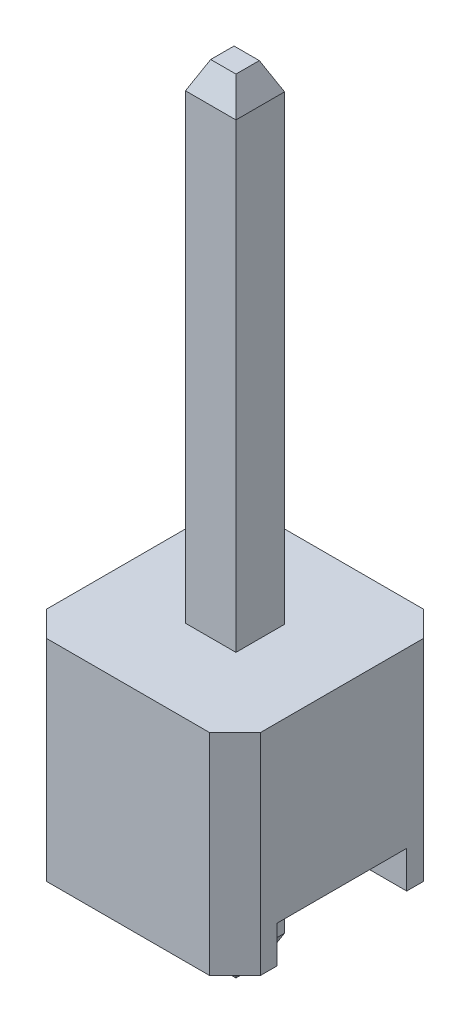
ISO-10303-21;
HEADER;
FILE_DESCRIPTION(('STEP AP214'),'2;1');
FILE_NAME('part.step','',(''),(''),'','','');
FILE_SCHEMA(('AUTOMOTIVE_DESIGN { 1 0 10303 214 1 1 1 1 }'));
ENDSEC;
DATA;
#1=APPLICATION_CONTEXT('core data for automotive mechanical design processes');
#2=APPLICATION_PROTOCOL_DEFINITION('international standard','automotive_design',2000,#1);
#3=PRODUCT_CONTEXT('',#1,'mechanical');
#4=PRODUCT('Part','Part','',(#3));
#5=PRODUCT_RELATED_PRODUCT_CATEGORY('part','',(#4));
#6=PRODUCT_DEFINITION_FORMATION('','',#4);
#7=PRODUCT_DEFINITION_CONTEXT('part definition',#1,'design');
#8=PRODUCT_DEFINITION('design','',#6,#7);
#9=PRODUCT_DEFINITION_SHAPE('','',#8);
#10=(LENGTH_UNIT() NAMED_UNIT(*) SI_UNIT(.MILLI.,.METRE.));
#11=(NAMED_UNIT(*) PLANE_ANGLE_UNIT() SI_UNIT($,.RADIAN.));
#12=(NAMED_UNIT(*) SI_UNIT($,.STERADIAN.) SOLID_ANGLE_UNIT());
#13=UNCERTAINTY_MEASURE_WITH_UNIT(LENGTH_MEASURE(1.E-05),#10,'distance_accuracy_value','');
#14=(GEOMETRIC_REPRESENTATION_CONTEXT(3) GLOBAL_UNCERTAINTY_ASSIGNED_CONTEXT((#13)) GLOBAL_UNIT_ASSIGNED_CONTEXT((#10,
#11,#12)) REPRESENTATION_CONTEXT('',''));
#15=CARTESIAN_POINT('',(0.,0.,0.));
#16=DIRECTION('',(0.,0.,1.));
#17=DIRECTION('',(1.,0.,0.));
#18=AXIS2_PLACEMENT_3D('',#15,#16,#17);
#19=CARTESIAN_POINT('',(15.6674969604626,-5.69124998633488,4.81287404611807));
#20=DIRECTION('',(0.,-1.,0.));
#21=DIRECTION('',(0.,0.,-1.));
#22=AXIS2_PLACEMENT_3D('',#19,#20,#21);
#23=PLANE('',#22);
#24=DIRECTION('',(1.,0.,0.));
#25=VECTOR('',#24,1.);
#26=CARTESIAN_POINT('',(15.0674969604626,-5.69124998633488,4.96287404611807));
#27=LINE('',#26,#25);
#28=CARTESIAN_POINT('',(15.2174969604626,-5.69124998633488,4.96287404611807));
#29=VERTEX_POINT('',#28);
#30=CARTESIAN_POINT('',(15.5174969604626,-5.69124998633488,4.96287404611807));
#31=VERTEX_POINT('',#30);
#32=EDGE_CURVE('E194',#29,#31,#27,.T.);
#33=ORIENTED_EDGE('',*,*,#32,.T.);
#34=DIRECTION('',(0.,0.,1.));
#35=VECTOR('',#34,1.);
#36=CARTESIAN_POINT('',(15.5174969604626,-5.69124998633488,4.81287404611807));
#37=LINE('',#36,#35);
#38=CARTESIAN_POINT('',(15.5174969604626,-5.69124998633488,5.24038017622598));
#39=VERTEX_POINT('',#38);
#40=EDGE_CURVE('E179',#31,#39,#37,.T.);
#41=ORIENTED_EDGE('',*,*,#40,.T.);
#42=DIRECTION('',(1.,0.,0.));
#43=VECTOR('',#42,1.);
#44=CARTESIAN_POINT('',(15.6674969604626,-5.69124998633488,5.24038017622598));
#45=LINE('',#44,#43);
#46=CARTESIAN_POINT('',(15.2174969604626,-5.69124998633488,5.24038017622598));
#47=VERTEX_POINT('',#46);
#48=EDGE_CURVE('E20',#39,#47,#45,.F.);
#49=ORIENTED_EDGE('',*,*,#48,.T.);
#50=DIRECTION('',(0.,0.,1.));
#51=VECTOR('',#50,1.);
#52=CARTESIAN_POINT('',(15.2174969604626,-5.69124998633488,5.39038017622598));
#53=LINE('',#52,#51);
#54=EDGE_CURVE('E174',#47,#29,#53,.F.);
#55=ORIENTED_EDGE('',*,*,#54,.T.);
#56=EDGE_LOOP('',(#33,#41,#49,#55));
#57=FACE_BOUND('',#56,.T.);
#58=ADVANCED_FACE('F17',(#57),#23,.T.);
#59=CARTESIAN_POINT('',(15.6674969604626,-5.36957394825845,5.39038017622598));
#60=DIRECTION('',(0.,0.4226182617407,-0.90630778703665));
#61=DIRECTION('',(0.,0.90630778703665,0.4226182617407));
#62=AXIS2_PLACEMENT_3D('',#59,#60,#61);
#63=PLANE('',#62);
#64=DIRECTION('',(1.,0.,0.));
#65=VECTOR('',#64,1.);
#66=CARTESIAN_POINT('',(15.6674969604626,-5.36957394825845,5.39038017622598));
#67=LINE('',#66,#65);
#68=CARTESIAN_POINT('',(15.0674969604626,-5.36957394825845,5.39038017622598));
#69=VERTEX_POINT('',#68);
#70=CARTESIAN_POINT('',(15.6674969604626,-5.36957394825845,5.39038017622598));
#71=VERTEX_POINT('',#70);
#72=EDGE_CURVE('E186',#69,#71,#67,.T.);
#73=ORIENTED_EDGE('',*,*,#72,.F.);
#74=DIRECTION('',(0.389281620635027,-0.834817129478987,-0.389281620635025));
#75=VECTOR('',#74,1.);
#76=CARTESIAN_POINT('',(15.0674969604626,-5.36957394825845,5.39038017622598));
#77=LINE('',#76,#75);
#78=EDGE_CURVE('E182',#69,#47,#77,.T.);
#79=ORIENTED_EDGE('',*,*,#78,.T.);
#80=ORIENTED_EDGE('',*,*,#48,.F.);
#81=DIRECTION('',(0.389281620635028,0.834817129478986,0.389281620635026));
#82=VECTOR('',#81,1.);
#83=CARTESIAN_POINT('',(15.5174969604626,-5.69124998633488,5.24038017622598));
#84=LINE('',#83,#82);
#85=EDGE_CURVE('E202',#39,#71,#84,.T.);
#86=ORIENTED_EDGE('',*,*,#85,.T.);
#87=EDGE_LOOP('',(#73,#79,#80,#86));
#88=FACE_BOUND('',#87,.T.);
#89=ADVANCED_FACE('F184',(#88),#63,.F.);
#90=CARTESIAN_POINT('',(15.0674969604626,-5.36957394825845,5.39038017622598));
#91=DIRECTION('',(0.906307787036649,0.422618261740701,0.));
#92=DIRECTION('',(-0.422618261740701,0.906307787036649,0.));
#93=AXIS2_PLACEMENT_3D('',#90,#91,#92);
#94=PLANE('',#93);
#95=ORIENTED_EDGE('',*,*,#54,.F.);
#96=ORIENTED_EDGE('',*,*,#78,.F.);
#97=DIRECTION('',(0.,0.,1.));
#98=VECTOR('',#97,1.);
#99=CARTESIAN_POINT('',(15.0674969604626,-5.36957394825845,5.39038017622598));
#100=LINE('',#99,#98);
#101=CARTESIAN_POINT('',(15.0674969604626,-5.36957394825845,4.81287404611807));
#102=VERTEX_POINT('',#101);
#103=EDGE_CURVE('E205',#102,#69,#100,.T.);
#104=ORIENTED_EDGE('',*,*,#103,.F.);
#105=DIRECTION('',(0.389281620635028,-0.834817129478986,0.389281620635026));
#106=VECTOR('',#105,1.);
#107=CARTESIAN_POINT('',(15.0674969604626,-5.36957394825845,4.81287404611807));
#108=LINE('',#107,#106);
#109=EDGE_CURVE('E191',#102,#29,#108,.T.);
#110=ORIENTED_EDGE('',*,*,#109,.T.);
#111=EDGE_LOOP('',(#95,#96,#104,#110));
#112=FACE_BOUND('',#111,.T.);
#113=ADVANCED_FACE('F189',(#112),#94,.F.);
#114=CARTESIAN_POINT('',(15.0674969604626,-5.36957394825845,4.81287404611807));
#115=DIRECTION('',(0.,0.422618261740701,0.906307787036649));
#116=DIRECTION('',(0.,-0.906307787036649,0.422618261740701));
#117=AXIS2_PLACEMENT_3D('',#114,#115,#116);
#118=PLANE('',#117);
#119=ORIENTED_EDGE('',*,*,#32,.F.);
#120=ORIENTED_EDGE('',*,*,#109,.F.);
#121=DIRECTION('',(-1.,0.,0.));
#122=VECTOR('',#121,1.);
#123=CARTESIAN_POINT('',(15.0674969604626,-5.36957394825845,4.81287404611807));
#124=LINE('',#123,#122);
#125=CARTESIAN_POINT('',(15.6674969604626,-5.36957394825845,4.81287404611807));
#126=VERTEX_POINT('',#125);
#127=EDGE_CURVE('E211',#126,#102,#124,.T.);
#128=ORIENTED_EDGE('',*,*,#127,.F.);
#129=DIRECTION('',(-0.389281620635029,-0.834817129478988,0.389281620635022));
#130=VECTOR('',#129,1.);
#131=CARTESIAN_POINT('',(15.6674969604626,-5.36957394825845,4.81287404611807));
#132=LINE('',#131,#130);
#133=EDGE_CURVE('E198',#126,#31,#132,.T.);
#134=ORIENTED_EDGE('',*,*,#133,.T.);
#135=EDGE_LOOP('',(#119,#120,#128,#134));
#136=FACE_BOUND('',#135,.T.);
#137=ADVANCED_FACE('F518',(#136),#118,.F.);
#138=CARTESIAN_POINT('',(15.6674969604626,-5.36957394825845,4.81287404611807));
#139=DIRECTION('',(-0.906307787036649,0.422618261740701,0.));
#140=DIRECTION('',(-0.422618261740701,-0.906307787036649,0.));
#141=AXIS2_PLACEMENT_3D('',#138,#139,#140);
#142=PLANE('',#141);
#143=ORIENTED_EDGE('',*,*,#40,.F.);
#144=ORIENTED_EDGE('',*,*,#133,.F.);
#145=DIRECTION('',(0.,0.,-1.));
#146=VECTOR('',#145,1.);
#147=CARTESIAN_POINT('',(15.6674969604626,-5.36957394825845,4.81287404611807));
#148=LINE('',#147,#146);
#149=EDGE_CURVE('E220',#71,#126,#148,.T.);
#150=ORIENTED_EDGE('',*,*,#149,.F.);
#151=ORIENTED_EDGE('',*,*,#85,.F.);
#152=EDGE_LOOP('',(#143,#144,#150,#151));
#153=FACE_BOUND('',#152,.T.);
#154=ADVANCED_FACE('F514',(#153),#142,.F.);
#155=CARTESIAN_POINT('',(15.6674969604626,-5.69124998633488,5.39038017622598));
#156=DIRECTION('',(0.,0.,1.));
#157=DIRECTION('',(1.,0.,0.));
#158=AXIS2_PLACEMENT_3D('',#155,#156,#157);
#159=PLANE('',#158);
#160=DIRECTION('',(0.,1.,0.));
#161=VECTOR('',#160,1.);
#162=CARTESIAN_POINT('',(15.6674969604626,-5.69124998633488,5.39038017622598));
#163=LINE('',#162,#161);
#164=CARTESIAN_POINT('',(15.6674969604626,-4.25124998633488,5.39038017622598));
#165=VERTEX_POINT('',#164);
#166=EDGE_CURVE('E217',#165,#71,#163,.F.);
#167=ORIENTED_EDGE('',*,*,#166,.F.);
#168=DIRECTION('',(1.,0.,0.));
#169=VECTOR('',#168,1.);
#170=CARTESIAN_POINT('',(14.0974969604626,-4.25124998633488,5.39038017622598));
#171=LINE('',#170,#169);
#172=CARTESIAN_POINT('',(15.0674969604626,-4.25124998633488,5.39038017622598));
#173=VERTEX_POINT('',#172);
#174=EDGE_CURVE('E230',#165,#173,#171,.F.);
#175=ORIENTED_EDGE('',*,*,#174,.T.);
#176=DIRECTION('',(0.,1.,0.));
#177=VECTOR('',#176,1.);
#178=CARTESIAN_POINT('',(15.0674969604626,-5.69124998633488,5.39038017622598));
#179=LINE('',#178,#177);
#180=EDGE_CURVE('E208',#69,#173,#179,.T.);
#181=ORIENTED_EDGE('',*,*,#180,.F.);
#182=ORIENTED_EDGE('',*,*,#72,.T.);
#183=EDGE_LOOP('',(#167,#175,#181,#182));
#184=FACE_BOUND('',#183,.T.);
#185=ADVANCED_FACE('F510',(#184),#159,.T.);
#186=CARTESIAN_POINT('',(15.0674969604626,-5.69124998633488,5.39038017622598));
#187=DIRECTION('',(-1.,0.,0.));
#188=DIRECTION('',(0.,0.,1.));
#189=AXIS2_PLACEMENT_3D('',#186,#187,#188);
#190=PLANE('',#189);
#191=ORIENTED_EDGE('',*,*,#180,.T.);
#192=DIRECTION('',(0.,0.,1.));
#193=VECTOR('',#192,1.);
#194=CARTESIAN_POINT('',(15.0674969604626,-4.25124998633488,5.87162711117202));
#195=LINE('',#194,#193);
#196=CARTESIAN_POINT('',(15.0674969604626,-4.25124998633488,4.81287404611807));
#197=VERTEX_POINT('',#196);
#198=EDGE_CURVE('E232',#173,#197,#195,.F.);
#199=ORIENTED_EDGE('',*,*,#198,.T.);
#200=DIRECTION('',(0.,1.,0.));
#201=VECTOR('',#200,1.);
#202=CARTESIAN_POINT('',(15.0674969604626,-5.69124998633488,4.81287404611807));
#203=LINE('',#202,#201);
#204=EDGE_CURVE('E214',#102,#197,#203,.T.);
#205=ORIENTED_EDGE('',*,*,#204,.F.);
#206=ORIENTED_EDGE('',*,*,#103,.T.);
#207=EDGE_LOOP('',(#191,#199,#205,#206));
#208=FACE_BOUND('',#207,.T.);
#209=ADVANCED_FACE('F506',(#208),#190,.T.);
#210=CARTESIAN_POINT('',(15.0674969604626,-5.69124998633488,4.81287404611807));
#211=DIRECTION('',(0.,0.,-1.));
#212=DIRECTION('',(-1.,0.,0.));
#213=AXIS2_PLACEMENT_3D('',#210,#211,#212);
#214=PLANE('',#213);
#215=ORIENTED_EDGE('',*,*,#204,.T.);
#216=DIRECTION('',(1.,0.,0.));
#217=VECTOR('',#216,1.);
#218=CARTESIAN_POINT('',(14.0974969604626,-4.25124998633488,4.81287404611807));
#219=LINE('',#218,#217);
#220=CARTESIAN_POINT('',(15.6674969604626,-4.25124998633488,4.81287404611807));
#221=VERTEX_POINT('',#220);
#222=EDGE_CURVE('E234',#197,#221,#219,.T.);
#223=ORIENTED_EDGE('',*,*,#222,.T.);
#224=DIRECTION('',(0.,1.,0.));
#225=VECTOR('',#224,1.);
#226=CARTESIAN_POINT('',(15.6674969604626,-5.69124998633488,4.81287404611807));
#227=LINE('',#226,#225);
#228=EDGE_CURVE('E223',#126,#221,#227,.T.);
#229=ORIENTED_EDGE('',*,*,#228,.F.);
#230=ORIENTED_EDGE('',*,*,#127,.T.);
#231=EDGE_LOOP('',(#215,#223,#229,#230));
#232=FACE_BOUND('',#231,.T.);
#233=ADVANCED_FACE('F502',(#232),#214,.T.);
#234=CARTESIAN_POINT('',(15.6674969604626,-5.69124998633488,4.81287404611807));
#235=DIRECTION('',(1.,0.,0.));
#236=DIRECTION('',(0.,0.,-1.));
#237=AXIS2_PLACEMENT_3D('',#234,#235,#236);
#238=PLANE('',#237);
#239=ORIENTED_EDGE('',*,*,#228,.T.);
#240=DIRECTION('',(0.,0.,1.));
#241=VECTOR('',#240,1.);
#242=CARTESIAN_POINT('',(15.6674969604626,-4.25124998633488,5.87162711117202));
#243=LINE('',#242,#241);
#244=EDGE_CURVE('E236',#221,#165,#243,.T.);
#245=ORIENTED_EDGE('',*,*,#244,.T.);
#246=ORIENTED_EDGE('',*,*,#166,.T.);
#247=ORIENTED_EDGE('',*,*,#149,.T.);
#248=EDGE_LOOP('',(#239,#245,#246,#247));
#249=FACE_BOUND('',#248,.T.);
#250=ADVANCED_FACE('F498',(#249),#238,.T.);
#251=CARTESIAN_POINT('',(14.0974969604626,-4.25124998633488,5.87162711117202));
#252=DIRECTION('',(0.,1.,0.));
#253=DIRECTION('',(0.,0.,1.));
#254=AXIS2_PLACEMENT_3D('',#251,#252,#253);
#255=PLANE('',#254);
#256=ORIENTED_EDGE('',*,*,#222,.F.);
#257=ORIENTED_EDGE('',*,*,#198,.F.);
#258=ORIENTED_EDGE('',*,*,#174,.F.);
#259=ORIENTED_EDGE('',*,*,#244,.F.);
#260=EDGE_LOOP('',(#256,#257,#258,#259));
#261=FACE_BOUND('',#260,.T.);
#262=DIRECTION('',(-1.,0.,0.));
#263=VECTOR('',#262,1.);
#264=CARTESIAN_POINT('',(14.0974969604626,-4.25124998633488,4.33162711117202));
#265=LINE('',#264,#263);
#266=CARTESIAN_POINT('',(14.0974969604626,-4.25124998633488,4.33162711117202));
#267=VERTEX_POINT('',#266);
#268=CARTESIAN_POINT('',(16.6374969604626,-4.25124998633488,4.33162711117202));
#269=VERTEX_POINT('',#268);
#270=EDGE_CURVE('E241',#267,#269,#265,.F.);
#271=ORIENTED_EDGE('',*,*,#270,.T.);
#272=DIRECTION('',(0.,0.,1.));
#273=VECTOR('',#272,1.);
#274=CARTESIAN_POINT('',(16.6374969604626,-4.25124998633488,5.87162711117202));
#275=LINE('',#274,#273);
#276=CARTESIAN_POINT('',(16.6374969604626,-4.25124998633488,5.87162711117202));
#277=VERTEX_POINT('',#276);
#278=EDGE_CURVE('E226',#277,#269,#275,.F.);
#279=ORIENTED_EDGE('',*,*,#278,.F.);
#280=DIRECTION('',(1.,0.,0.));
#281=VECTOR('',#280,1.);
#282=CARTESIAN_POINT('',(14.0974969604626,-4.25124998633488,5.87162711117202));
#283=LINE('',#282,#281);
#284=CARTESIAN_POINT('',(14.0974969604626,-4.25124998633488,5.87162711117202));
#285=VERTEX_POINT('',#284);
#286=EDGE_CURVE('E248',#277,#285,#283,.F.);
#287=ORIENTED_EDGE('',*,*,#286,.T.);
#288=DIRECTION('',(0.,0.,1.));
#289=VECTOR('',#288,1.);
#290=CARTESIAN_POINT('',(14.0974969604626,-4.25124998633488,5.87162711117202));
#291=LINE('',#290,#289);
#292=EDGE_CURVE('E228',#267,#285,#291,.T.);
#293=ORIENTED_EDGE('',*,*,#292,.F.);
#294=EDGE_LOOP('',(#271,#279,#287,#293));
#295=FACE_BOUND('',#294,.T.);
#296=ADVANCED_FACE('F495',(#261,#295),#255,.F.);
#297=CARTESIAN_POINT('',(15.5174969604626,3.60875001366512,4.81287404611807));
#298=DIRECTION('',(0.906307787036651,0.422618261740697,0.));
#299=DIRECTION('',(-0.422618261740697,0.906307787036651,0.));
#300=AXIS2_PLACEMENT_3D('',#297,#298,#299);
#301=PLANE('',#300);
#302=DIRECTION('',(0.389281620635022,-0.83481712947899,-0.389281620635024));
#303=VECTOR('',#302,1.);
#304=CARTESIAN_POINT('',(15.5174969604626,3.60875001366512,4.96287404611807));
#305=LINE('',#304,#303);
#306=CARTESIAN_POINT('',(15.5174969604626,3.60875001366512,4.96287404611807));
#307=VERTEX_POINT('',#306);
#308=CARTESIAN_POINT('',(15.6674969604626,3.28707397558869,4.81287404611807));
#309=VERTEX_POINT('',#308);
#310=EDGE_CURVE('E263',#307,#309,#305,.T.);
#311=ORIENTED_EDGE('',*,*,#310,.F.);
#312=DIRECTION('',(0.,0.,-1.));
#313=VECTOR('',#312,1.);
#314=CARTESIAN_POINT('',(15.5174969604626,3.60875001366512,4.81287404611807));
#315=LINE('',#314,#313);
#316=CARTESIAN_POINT('',(15.5174969604626,3.60875001366512,5.24038017622598));
#317=VERTEX_POINT('',#316);
#318=EDGE_CURVE('E256',#307,#317,#315,.F.);
#319=ORIENTED_EDGE('',*,*,#318,.T.);
#320=DIRECTION('',(-0.389281620635021,0.834817129478991,-0.389281620635023));
#321=VECTOR('',#320,1.);
#322=CARTESIAN_POINT('',(15.6674969604626,3.28707397558869,5.39038017622598));
#323=LINE('',#322,#321);
#324=CARTESIAN_POINT('',(15.6674969604626,3.28707397558869,5.39038017622598));
#325=VERTEX_POINT('',#324);
#326=EDGE_CURVE('E253',#325,#317,#323,.T.);
#327=ORIENTED_EDGE('',*,*,#326,.F.);
#328=DIRECTION('',(0.,0.,-1.));
#329=VECTOR('',#328,1.);
#330=CARTESIAN_POINT('',(15.6674969604626,3.28707397558869,4.81287404611807));
#331=LINE('',#330,#329);
#332=EDGE_CURVE('E266',#309,#325,#331,.F.);
#333=ORIENTED_EDGE('',*,*,#332,.F.);
#334=EDGE_LOOP('',(#311,#319,#327,#333));
#335=FACE_BOUND('',#334,.T.);
#336=ADVANCED_FACE('F472',(#335),#301,.T.);
#337=CARTESIAN_POINT('',(14.0974969604626,-4.25124998633488,4.33162711117202));
#338=DIRECTION('',(0.,0.,-1.));
#339=DIRECTION('',(-1.,0.,0.));
#340=AXIS2_PLACEMENT_3D('',#337,#338,#339);
#341=PLANE('',#340);
#342=DIRECTION('',(0.,1.,0.));
#343=VECTOR('',#342,1.);
#344=CARTESIAN_POINT('',(16.6374969604626,-4.25124998633488,4.33162711117202));
#345=LINE('',#344,#343);
#346=CARTESIAN_POINT('',(16.6374969604626,-4.69124998633488,4.33162711117202));
#347=VERTEX_POINT('',#346);
#348=EDGE_CURVE('E244',#269,#347,#345,.F.);
#349=ORIENTED_EDGE('',*,*,#348,.F.);
#350=ORIENTED_EDGE('',*,*,#270,.F.);
#351=DIRECTION('',(0.,1.,0.));
#352=VECTOR('',#351,1.);
#353=CARTESIAN_POINT('',(14.0974969604626,-4.25124998633488,4.33162711117202));
#354=LINE('',#353,#352);
#355=CARTESIAN_POINT('',(14.0974969604626,-4.69124998633488,4.33162711117202));
#356=VERTEX_POINT('',#355);
#357=EDGE_CURVE('E239',#356,#267,#354,.T.);
#358=ORIENTED_EDGE('',*,*,#357,.F.);
#359=DIRECTION('',(1.,0.,0.));
#360=VECTOR('',#359,1.);
#361=CARTESIAN_POINT('',(15.3674969604626,-4.69124998633488,4.33162711117202));
#362=LINE('',#361,#360);
#363=EDGE_CURVE('E273',#356,#347,#362,.T.);
#364=ORIENTED_EDGE('',*,*,#363,.T.);
#365=EDGE_LOOP('',(#349,#350,#358,#364));
#366=FACE_BOUND('',#365,.T.);
#367=ADVANCED_FACE('F488',(#366),#341,.F.);
#368=CARTESIAN_POINT('',(14.0974969604626,-4.25124998633488,5.87162711117202));
#369=DIRECTION('',(0.,0.,1.));
#370=DIRECTION('',(1.,0.,0.));
#371=AXIS2_PLACEMENT_3D('',#368,#369,#370);
#372=PLANE('',#371);
#373=DIRECTION('',(0.,1.,0.));
#374=VECTOR('',#373,1.);
#375=CARTESIAN_POINT('',(14.0974969604626,-4.25124998633488,5.87162711117202));
#376=LINE('',#375,#374);
#377=CARTESIAN_POINT('',(14.0974969604626,-4.69124998633488,5.87162711117202));
#378=VERTEX_POINT('',#377);
#379=EDGE_CURVE('E251',#285,#378,#376,.F.);
#380=ORIENTED_EDGE('',*,*,#379,.F.);
#381=ORIENTED_EDGE('',*,*,#286,.F.);
#382=DIRECTION('',(0.,1.,0.));
#383=VECTOR('',#382,1.);
#384=CARTESIAN_POINT('',(16.6374969604626,-4.25124998633488,5.87162711117202));
#385=LINE('',#384,#383);
#386=CARTESIAN_POINT('',(16.6374969604626,-4.69124998633488,5.87162711117202));
#387=VERTEX_POINT('',#386);
#388=EDGE_CURVE('E246',#387,#277,#385,.T.);
#389=ORIENTED_EDGE('',*,*,#388,.F.);
#390=DIRECTION('',(1.,0.,0.));
#391=VECTOR('',#390,1.);
#392=CARTESIAN_POINT('',(15.3674969604626,-4.69124998633488,5.87162711117202));
#393=LINE('',#392,#391);
#394=EDGE_CURVE('E288',#387,#378,#393,.F.);
#395=ORIENTED_EDGE('',*,*,#394,.T.);
#396=EDGE_LOOP('',(#380,#381,#389,#395));
#397=FACE_BOUND('',#396,.T.);
#398=ADVANCED_FACE('F482',(#397),#372,.F.);
#399=CARTESIAN_POINT('',(15.6674969604626,3.60875001366512,5.24038017622598));
#400=DIRECTION('',(0.,0.422618261740697,0.906307787036651));
#401=DIRECTION('',(0.,-0.906307787036651,0.422618261740697));
#402=AXIS2_PLACEMENT_3D('',#399,#400,#401);
#403=PLANE('',#402);
#404=ORIENTED_EDGE('',*,*,#326,.T.);
#405=DIRECTION('',(1.,0.,0.));
#406=VECTOR('',#405,1.);
#407=CARTESIAN_POINT('',(15.6674969604626,3.60875001366512,5.24038017622598));
#408=LINE('',#407,#406);
#409=CARTESIAN_POINT('',(15.2174969604626,3.60875001366512,5.24038017622598));
#410=VERTEX_POINT('',#409);
#411=EDGE_CURVE('E258',#317,#410,#408,.F.);
#412=ORIENTED_EDGE('',*,*,#411,.T.);
#413=DIRECTION('',(0.389281620635024,0.83481712947899,-0.389281620635022));
#414=VECTOR('',#413,1.);
#415=CARTESIAN_POINT('',(15.0674969604626,3.28707397558869,5.39038017622598));
#416=LINE('',#415,#414);
#417=CARTESIAN_POINT('',(15.0674969604626,3.28707397558869,5.39038017622598));
#418=VERTEX_POINT('',#417);
#419=EDGE_CURVE('E310',#418,#410,#416,.T.);
#420=ORIENTED_EDGE('',*,*,#419,.F.);
#421=DIRECTION('',(1.,0.,0.));
#422=VECTOR('',#421,1.);
#423=CARTESIAN_POINT('',(15.6674969604626,3.28707397558869,5.39038017622598));
#424=LINE('',#423,#422);
#425=EDGE_CURVE('E303',#325,#418,#424,.F.);
#426=ORIENTED_EDGE('',*,*,#425,.F.);
#427=EDGE_LOOP('',(#404,#412,#420,#426));
#428=FACE_BOUND('',#427,.T.);
#429=ADVANCED_FACE('F466',(#428),#403,.T.);
#430=CARTESIAN_POINT('',(15.6674969604626,3.60875001366512,4.81287404611807));
#431=DIRECTION('',(0.,-1.,0.));
#432=DIRECTION('',(0.,0.,-1.));
#433=AXIS2_PLACEMENT_3D('',#430,#431,#432);
#434=PLANE('',#433);
#435=ORIENTED_EDGE('',*,*,#318,.F.);
#436=DIRECTION('',(1.,0.,0.));
#437=VECTOR('',#436,1.);
#438=CARTESIAN_POINT('',(15.6674969604626,3.60875001366512,4.96287404611807));
#439=LINE('',#438,#437);
#440=CARTESIAN_POINT('',(15.2174969604626,3.60875001366512,4.96287404611807));
#441=VERTEX_POINT('',#440);
#442=EDGE_CURVE('E260',#441,#307,#439,.T.);
#443=ORIENTED_EDGE('',*,*,#442,.F.);
#444=DIRECTION('',(0.,0.,1.));
#445=VECTOR('',#444,1.);
#446=CARTESIAN_POINT('',(15.2174969604626,3.60875001366512,4.81287404611807));
#447=LINE('',#446,#445);
#448=EDGE_CURVE('E313',#410,#441,#447,.F.);
#449=ORIENTED_EDGE('',*,*,#448,.F.);
#450=ORIENTED_EDGE('',*,*,#411,.F.);
#451=EDGE_LOOP('',(#435,#443,#449,#450));
#452=FACE_BOUND('',#451,.T.);
#453=ADVANCED_FACE('F474',(#452),#434,.F.);
#454=CARTESIAN_POINT('',(15.6674969604626,3.60875001366512,4.96287404611807));
#455=DIRECTION('',(0.,0.422618261740697,-0.906307787036651));
#456=DIRECTION('',(0.,0.906307787036651,0.422618261740697));
#457=AXIS2_PLACEMENT_3D('',#454,#455,#456);
#458=PLANE('',#457);
#459=ORIENTED_EDGE('',*,*,#310,.T.);
#460=DIRECTION('',(-1.,0.,0.));
#461=VECTOR('',#460,1.);
#462=CARTESIAN_POINT('',(15.0674969604626,3.28707397558869,4.81287404611807));
#463=LINE('',#462,#461);
#464=CARTESIAN_POINT('',(15.0674969604626,3.28707397558869,4.81287404611807));
#465=VERTEX_POINT('',#464);
#466=EDGE_CURVE('E316',#465,#309,#463,.F.);
#467=ORIENTED_EDGE('',*,*,#466,.F.);
#468=DIRECTION('',(-0.389281620635025,-0.834817129478991,-0.389281620635018));
#469=VECTOR('',#468,1.);
#470=CARTESIAN_POINT('',(15.2174969604626,3.60875001366512,4.96287404611807));
#471=LINE('',#470,#469);
#472=EDGE_CURVE('E307',#441,#465,#471,.T.);
#473=ORIENTED_EDGE('',*,*,#472,.F.);
#474=ORIENTED_EDGE('',*,*,#442,.T.);
#475=EDGE_LOOP('',(#459,#467,#473,#474));
#476=FACE_BOUND('',#475,.T.);
#477=ADVANCED_FACE('F471',(#476),#458,.T.);
#478=CARTESIAN_POINT('',(15.6674969604626,-5.69124998633488,4.81287404611807));
#479=DIRECTION('',(1.,0.,0.));
#480=DIRECTION('',(0.,0.,-1.));
#481=AXIS2_PLACEMENT_3D('',#478,#479,#480);
#482=PLANE('',#481);
#483=DIRECTION('',(0.,1.,0.));
#484=VECTOR('',#483,1.);
#485=CARTESIAN_POINT('',(15.6674969604626,-5.69124998633488,5.39038017622598));
#486=LINE('',#485,#484);
#487=CARTESIAN_POINT('',(15.6674969604626,-2.19124998633488,5.39038017622598));
#488=VERTEX_POINT('',#487);
#489=EDGE_CURVE('E300',#488,#325,#486,.T.);
#490=ORIENTED_EDGE('',*,*,#489,.F.);
#491=DIRECTION('',(0.,0.,-1.));
#492=VECTOR('',#491,1.);
#493=CARTESIAN_POINT('',(15.6674969604626,-2.19124998633488,4.81287404611807));
#494=LINE('',#493,#492);
#495=CARTESIAN_POINT('',(15.6674969604626,-2.19124998633488,4.81287404611807));
#496=VERTEX_POINT('',#495);
#497=EDGE_CURVE('E269',#488,#496,#494,.T.);
#498=ORIENTED_EDGE('',*,*,#497,.T.);
#499=DIRECTION('',(0.,1.,0.));
#500=VECTOR('',#499,1.);
#501=CARTESIAN_POINT('',(15.6674969604626,-5.69124998633488,4.81287404611807));
#502=LINE('',#501,#500);
#503=EDGE_CURVE('E319',#309,#496,#502,.F.);
#504=ORIENTED_EDGE('',*,*,#503,.F.);
#505=ORIENTED_EDGE('',*,*,#332,.T.);
#506=EDGE_LOOP('',(#490,#498,#504,#505));
#507=FACE_BOUND('',#506,.T.);
#508=ADVANCED_FACE('F462',(#507),#482,.T.);
#509=CARTESIAN_POINT('',(15.3674969604626,-4.69124998633488,2.86162711117202));
#510=DIRECTION('',(0.,1.,0.));
#511=DIRECTION('',(0.,0.,1.));
#512=AXIS2_PLACEMENT_3D('',#509,#510,#511);
#513=PLANE('',#512);
#514=ORIENTED_EDGE('',*,*,#363,.F.);
#515=DIRECTION('',(0.,0.,1.));
#516=VECTOR('',#515,1.);
#517=CARTESIAN_POINT('',(14.0974969604626,-4.69124998633488,2.86162711117202));
#518=LINE('',#517,#516);
#519=CARTESIAN_POINT('',(14.0974969604626,-4.69124998633488,4.13162711117202));
#520=VERTEX_POINT('',#519);
#521=EDGE_CURVE('E271',#520,#356,#518,.T.);
#522=ORIENTED_EDGE('',*,*,#521,.F.);
#523=DIRECTION('',(0.707106781186547,0.,-0.707106781186548));
#524=VECTOR('',#523,1.);
#525=CARTESIAN_POINT('',(14.3974969604626,-4.69124998633488,3.83162711117202));
#526=LINE('',#525,#524);
#527=CARTESIAN_POINT('',(14.3974969604626,-4.69124998633488,3.83162711117202));
#528=VERTEX_POINT('',#527);
#529=EDGE_CURVE('E280',#520,#528,#526,.T.);
#530=ORIENTED_EDGE('',*,*,#529,.T.);
#531=DIRECTION('',(1.,0.,0.));
#532=VECTOR('',#531,1.);
#533=CARTESIAN_POINT('',(16.3374969604626,-4.69124998633488,3.83162711117202));
#534=LINE('',#533,#532);
#535=CARTESIAN_POINT('',(16.3374969604626,-4.69124998633488,3.83162711117202));
#536=VERTEX_POINT('',#535);
#537=EDGE_CURVE('E330',#528,#536,#534,.T.);
#538=ORIENTED_EDGE('',*,*,#537,.T.);
#539=DIRECTION('',(0.707106781186546,0.,0.707106781186549));
#540=VECTOR('',#539,1.);
#541=CARTESIAN_POINT('',(16.6374969604626,-4.69124998633488,4.13162711117202));
#542=LINE('',#541,#540);
#543=CARTESIAN_POINT('',(16.6374969604626,-4.69124998633488,4.13162711117202));
#544=VERTEX_POINT('',#543);
#545=EDGE_CURVE('E297',#536,#544,#542,.T.);
#546=ORIENTED_EDGE('',*,*,#545,.T.);
#547=DIRECTION('',(0.,0.,1.));
#548=VECTOR('',#547,1.);
#549=CARTESIAN_POINT('',(16.6374969604626,-4.69124998633488,2.86162711117202));
#550=LINE('',#549,#548);
#551=EDGE_CURVE('E276',#347,#544,#550,.F.);
#552=ORIENTED_EDGE('',*,*,#551,.F.);
#553=EDGE_LOOP('',(#514,#522,#530,#538,#546,#552));
#554=FACE_BOUND('',#553,.T.);
#555=ADVANCED_FACE('F630',(#554),#513,.F.);
#556=CARTESIAN_POINT('',(14.3974969604626,-2.19124998633488,3.83162711117202));
#557=DIRECTION('',(0.707106781186548,0.,0.707106781186547));
#558=DIRECTION('',(0.707106781186547,0.,-0.707106781186548));
#559=AXIS2_PLACEMENT_3D('',#556,#557,#558);
#560=PLANE('',#559);
#561=DIRECTION('',(0.,1.,0.));
#562=VECTOR('',#561,1.);
#563=CARTESIAN_POINT('',(14.0974969604626,-2.19124998633488,4.13162711117202));
#564=LINE('',#563,#562);
#565=CARTESIAN_POINT('',(14.0974969604626,-2.19124998633488,4.13162711117202));
#566=VERTEX_POINT('',#565);
#567=EDGE_CURVE('E333',#520,#566,#564,.T.);
#568=ORIENTED_EDGE('',*,*,#567,.T.);
#569=DIRECTION('',(0.707106781186547,0.,-0.707106781186548));
#570=VECTOR('',#569,1.);
#571=CARTESIAN_POINT('',(14.3974969604626,-2.19124998633488,3.83162711117202));
#572=LINE('',#571,#570);
#573=CARTESIAN_POINT('',(14.3974969604626,-2.19124998633488,3.83162711117202));
#574=VERTEX_POINT('',#573);
#575=EDGE_CURVE('E278',#574,#566,#572,.F.);
#576=ORIENTED_EDGE('',*,*,#575,.F.);
#577=DIRECTION('',(0.,1.,0.));
#578=VECTOR('',#577,1.);
#579=CARTESIAN_POINT('',(14.3974969604626,-2.19124998633488,3.83162711117202));
#580=LINE('',#579,#578);
#581=EDGE_CURVE('E327',#574,#528,#580,.F.);
#582=ORIENTED_EDGE('',*,*,#581,.T.);
#583=ORIENTED_EDGE('',*,*,#529,.F.);
#584=EDGE_LOOP('',(#568,#576,#582,#583));
#585=FACE_BOUND('',#584,.T.);
#586=ADVANCED_FACE('F395',(#585),#560,.F.);
#587=CARTESIAN_POINT('',(14.0974969604626,-2.19124998633488,6.07162711117202));
#588=DIRECTION('',(0.707106781186547,0.,-0.707106781186548));
#589=DIRECTION('',(-0.707106781186548,0.,-0.707106781186547));
#590=AXIS2_PLACEMENT_3D('',#587,#588,#589);
#591=PLANE('',#590);
#592=DIRECTION('',(0.,1.,0.));
#593=VECTOR('',#592,1.);
#594=CARTESIAN_POINT('',(14.3974969604626,-2.19124998633488,6.37162711117202));
#595=LINE('',#594,#593);
#596=CARTESIAN_POINT('',(14.3974969604626,-4.69124998633488,6.37162711117202));
#597=VERTEX_POINT('',#596);
#598=CARTESIAN_POINT('',(14.3974969604626,-2.19124998633488,6.37162711117202));
#599=VERTEX_POINT('',#598);
#600=EDGE_CURVE('E341',#597,#599,#595,.T.);
#601=ORIENTED_EDGE('',*,*,#600,.T.);
#602=DIRECTION('',(-0.707106781186548,0.,-0.707106781186547));
#603=VECTOR('',#602,1.);
#604=CARTESIAN_POINT('',(14.0974969604626,-2.19124998633488,6.07162711117202));
#605=LINE('',#604,#603);
#606=CARTESIAN_POINT('',(14.0974969604626,-2.19124998633488,6.07162711117202));
#607=VERTEX_POINT('',#606);
#608=EDGE_CURVE('E282',#607,#599,#605,.F.);
#609=ORIENTED_EDGE('',*,*,#608,.F.);
#610=DIRECTION('',(0.,1.,0.));
#611=VECTOR('',#610,1.);
#612=CARTESIAN_POINT('',(14.0974969604626,-2.19124998633488,6.07162711117202));
#613=LINE('',#612,#611);
#614=CARTESIAN_POINT('',(14.0974969604626,-4.69124998633488,6.07162711117202));
#615=VERTEX_POINT('',#614);
#616=EDGE_CURVE('E336',#607,#615,#613,.F.);
#617=ORIENTED_EDGE('',*,*,#616,.T.);
#618=DIRECTION('',(0.707106781186551,0.,0.707106781186544));
#619=VECTOR('',#618,1.);
#620=CARTESIAN_POINT('',(14.0974969604626,-4.69124998633488,6.07162711117202));
#621=LINE('',#620,#619);
#622=EDGE_CURVE('E284',#615,#597,#621,.T.);
#623=ORIENTED_EDGE('',*,*,#622,.T.);
#624=EDGE_LOOP('',(#601,#609,#617,#623));
#625=FACE_BOUND('',#624,.T.);
#626=ADVANCED_FACE('F402',(#625),#591,.F.);
#627=CARTESIAN_POINT('',(15.3674969604626,-4.69124998633488,2.86162711117202));
#628=DIRECTION('',(0.,1.,0.));
#629=DIRECTION('',(0.,0.,1.));
#630=AXIS2_PLACEMENT_3D('',#627,#628,#629);
#631=PLANE('',#630);
#632=ORIENTED_EDGE('',*,*,#394,.F.);
#633=DIRECTION('',(0.,0.,1.));
#634=VECTOR('',#633,1.);
#635=CARTESIAN_POINT('',(16.6374969604626,-4.69124998633488,2.86162711117202));
#636=LINE('',#635,#634);
#637=CARTESIAN_POINT('',(16.6374969604626,-4.69124998633488,6.07162711117202));
#638=VERTEX_POINT('',#637);
#639=EDGE_CURVE('E286',#638,#387,#636,.F.);
#640=ORIENTED_EDGE('',*,*,#639,.F.);
#641=DIRECTION('',(-0.707106781186549,0.,0.707106781186546));
#642=VECTOR('',#641,1.);
#643=CARTESIAN_POINT('',(16.3374969604626,-4.69124998633488,6.37162711117202));
#644=LINE('',#643,#642);
#645=CARTESIAN_POINT('',(16.3374969604626,-4.69124998633488,6.37162711117202));
#646=VERTEX_POINT('',#645);
#647=EDGE_CURVE('E293',#638,#646,#644,.T.);
#648=ORIENTED_EDGE('',*,*,#647,.T.);
#649=DIRECTION('',(-1.,0.,0.));
#650=VECTOR('',#649,1.);
#651=CARTESIAN_POINT('',(14.3974969604626,-4.69124998633488,6.37162711117202));
#652=LINE('',#651,#650);
#653=EDGE_CURVE('E347',#646,#597,#652,.T.);
#654=ORIENTED_EDGE('',*,*,#653,.T.);
#655=ORIENTED_EDGE('',*,*,#622,.F.);
#656=DIRECTION('',(0.,0.,-1.));
#657=VECTOR('',#656,1.);
#658=CARTESIAN_POINT('',(14.0974969604626,-4.69124998633488,4.13162711117202));
#659=LINE('',#658,#657);
#660=EDGE_CURVE('E338',#615,#378,#659,.T.);
#661=ORIENTED_EDGE('',*,*,#660,.T.);
#662=EDGE_LOOP('',(#632,#640,#648,#654,#655,#661));
#663=FACE_BOUND('',#662,.T.);
#664=ADVANCED_FACE('F405',(#663),#631,.F.);
#665=CARTESIAN_POINT('',(16.3374969604626,-2.19124998633488,6.37162711117202));
#666=DIRECTION('',(-0.707106781186546,0.,-0.707106781186549));
#667=DIRECTION('',(-0.707106781186549,0.,0.707106781186546));
#668=AXIS2_PLACEMENT_3D('',#665,#666,#667);
#669=PLANE('',#668);
#670=DIRECTION('',(0.,1.,0.));
#671=VECTOR('',#670,1.);
#672=CARTESIAN_POINT('',(16.6374969604626,-2.19124998633488,6.07162711117202));
#673=LINE('',#672,#671);
#674=CARTESIAN_POINT('',(16.6374969604626,-2.19124998633488,6.07162711117202));
#675=VERTEX_POINT('',#674);
#676=EDGE_CURVE('E350',#638,#675,#673,.T.);
#677=ORIENTED_EDGE('',*,*,#676,.T.);
#678=DIRECTION('',(-0.707106781186549,0.,0.707106781186546));
#679=VECTOR('',#678,1.);
#680=CARTESIAN_POINT('',(16.3374969604626,-2.19124998633488,6.37162711117202));
#681=LINE('',#680,#679);
#682=CARTESIAN_POINT('',(16.3374969604626,-2.19124998633488,6.37162711117202));
#683=VERTEX_POINT('',#682);
#684=EDGE_CURVE('E291',#683,#675,#681,.F.);
#685=ORIENTED_EDGE('',*,*,#684,.F.);
#686=DIRECTION('',(0.,1.,0.));
#687=VECTOR('',#686,1.);
#688=CARTESIAN_POINT('',(16.3374969604626,-2.19124998633488,6.37162711117202));
#689=LINE('',#688,#687);
#690=EDGE_CURVE('E344',#683,#646,#689,.F.);
#691=ORIENTED_EDGE('',*,*,#690,.T.);
#692=ORIENTED_EDGE('',*,*,#647,.F.);
#693=EDGE_LOOP('',(#677,#685,#691,#692));
#694=FACE_BOUND('',#693,.T.);
#695=ADVANCED_FACE('F414',(#694),#669,.F.);
#696=CARTESIAN_POINT('',(16.6374969604626,-2.19124998633488,4.13162711117202));
#697=DIRECTION('',(-0.707106781186549,0.,0.707106781186546));
#698=DIRECTION('',(0.707106781186546,0.,0.707106781186549));
#699=AXIS2_PLACEMENT_3D('',#696,#697,#698);
#700=PLANE('',#699);
#701=DIRECTION('',(0.,1.,0.));
#702=VECTOR('',#701,1.);
#703=CARTESIAN_POINT('',(16.3374969604626,-2.19124998633488,3.83162711117202));
#704=LINE('',#703,#702);
#705=CARTESIAN_POINT('',(16.3374969604626,-2.19124998633488,3.83162711117202));
#706=VERTEX_POINT('',#705);
#707=EDGE_CURVE('E324',#536,#706,#704,.T.);
#708=ORIENTED_EDGE('',*,*,#707,.T.);
#709=DIRECTION('',(0.707106781186546,0.,0.707106781186549));
#710=VECTOR('',#709,1.);
#711=CARTESIAN_POINT('',(16.6374969604626,-2.19124998633488,4.13162711117202));
#712=LINE('',#711,#710);
#713=CARTESIAN_POINT('',(16.6374969604626,-2.19124998633488,4.13162711117202));
#714=VERTEX_POINT('',#713);
#715=EDGE_CURVE('E295',#714,#706,#712,.F.);
#716=ORIENTED_EDGE('',*,*,#715,.F.);
#717=DIRECTION('',(0.,1.,0.));
#718=VECTOR('',#717,1.);
#719=CARTESIAN_POINT('',(16.6374969604626,-2.19124998633488,4.13162711117202));
#720=LINE('',#719,#718);
#721=EDGE_CURVE('E353',#714,#544,#720,.F.);
#722=ORIENTED_EDGE('',*,*,#721,.T.);
#723=ORIENTED_EDGE('',*,*,#545,.F.);
#724=EDGE_LOOP('',(#708,#716,#722,#723));
#725=FACE_BOUND('',#724,.T.);
#726=ADVANCED_FACE('F384',(#725),#700,.F.);
#727=CARTESIAN_POINT('',(15.6674969604626,-5.69124998633488,5.39038017622598));
#728=DIRECTION('',(0.,0.,1.));
#729=DIRECTION('',(1.,0.,0.));
#730=AXIS2_PLACEMENT_3D('',#727,#728,#729);
#731=PLANE('',#730);
#732=DIRECTION('',(0.,1.,0.));
#733=VECTOR('',#732,1.);
#734=CARTESIAN_POINT('',(15.0674969604626,-5.69124998633488,5.39038017622598));
#735=LINE('',#734,#733);
#736=CARTESIAN_POINT('',(15.0674969604626,-2.19124998633488,5.39038017622598));
#737=VERTEX_POINT('',#736);
#738=EDGE_CURVE('E356',#737,#418,#735,.T.);
#739=ORIENTED_EDGE('',*,*,#738,.F.);
#740=DIRECTION('',(1.,0.,0.));
#741=VECTOR('',#740,1.);
#742=CARTESIAN_POINT('',(15.6674969604626,-2.19124998633488,5.39038017622598));
#743=LINE('',#742,#741);
#744=EDGE_CURVE('E34',#737,#488,#743,.T.);
#745=ORIENTED_EDGE('',*,*,#744,.T.);
#746=ORIENTED_EDGE('',*,*,#489,.T.);
#747=ORIENTED_EDGE('',*,*,#425,.T.);
#748=EDGE_LOOP('',(#739,#745,#746,#747));
#749=FACE_BOUND('',#748,.T.);
#750=ADVANCED_FACE('F422',(#749),#731,.T.);
#751=CARTESIAN_POINT('',(15.2174969604626,3.60875001366512,4.81287404611807));
#752=DIRECTION('',(-0.906307787036651,0.422618261740697,0.));
#753=DIRECTION('',(-0.422618261740697,-0.906307787036651,0.));
#754=AXIS2_PLACEMENT_3D('',#751,#752,#753);
#755=PLANE('',#754);
#756=ORIENTED_EDGE('',*,*,#419,.T.);
#757=ORIENTED_EDGE('',*,*,#448,.T.);
#758=ORIENTED_EDGE('',*,*,#472,.T.);
#759=DIRECTION('',(0.,0.,1.));
#760=VECTOR('',#759,1.);
#761=CARTESIAN_POINT('',(15.0674969604626,3.28707397558869,5.39038017622598));
#762=LINE('',#761,#760);
#763=EDGE_CURVE('E359',#418,#465,#762,.F.);
#764=ORIENTED_EDGE('',*,*,#763,.F.);
#765=EDGE_LOOP('',(#756,#757,#758,#764));
#766=FACE_BOUND('',#765,.T.);
#767=ADVANCED_FACE('F445',(#766),#755,.T.);
#768=CARTESIAN_POINT('',(15.0674969604626,-5.69124998633488,4.81287404611807));
#769=DIRECTION('',(0.,0.,-1.));
#770=DIRECTION('',(-1.,0.,0.));
#771=AXIS2_PLACEMENT_3D('',#768,#769,#770);
#772=PLANE('',#771);
#773=ORIENTED_EDGE('',*,*,#503,.T.);
#774=DIRECTION('',(-1.,0.,0.));
#775=VECTOR('',#774,1.);
#776=CARTESIAN_POINT('',(15.0674969604626,-2.19124998633488,4.81287404611807));
#777=LINE('',#776,#775);
#778=CARTESIAN_POINT('',(15.0674969604626,-2.19124998633488,4.81287404611807));
#779=VERTEX_POINT('',#778);
#780=EDGE_CURVE('E322',#496,#779,#777,.T.);
#781=ORIENTED_EDGE('',*,*,#780,.T.);
#782=DIRECTION('',(0.,1.,0.));
#783=VECTOR('',#782,1.);
#784=CARTESIAN_POINT('',(15.0674969604626,-5.69124998633488,4.81287404611807));
#785=LINE('',#784,#783);
#786=EDGE_CURVE('E362',#465,#779,#785,.F.);
#787=ORIENTED_EDGE('',*,*,#786,.F.);
#788=ORIENTED_EDGE('',*,*,#466,.T.);
#789=EDGE_LOOP('',(#773,#781,#787,#788));
#790=FACE_BOUND('',#789,.T.);
#791=ADVANCED_FACE('F442',(#790),#772,.T.);
#792=CARTESIAN_POINT('',(16.3374969604626,-2.19124998633488,3.83162711117202));
#793=DIRECTION('',(0.,0.,1.));
#794=DIRECTION('',(1.,0.,0.));
#795=AXIS2_PLACEMENT_3D('',#792,#793,#794);
#796=PLANE('',#795);
#797=ORIENTED_EDGE('',*,*,#581,.F.);
#798=DIRECTION('',(1.,0.,0.));
#799=VECTOR('',#798,1.);
#800=CARTESIAN_POINT('',(15.3674969604626,-2.19124998633488,3.83162711117202));
#801=LINE('',#800,#799);
#802=EDGE_CURVE('E365',#706,#574,#801,.F.);
#803=ORIENTED_EDGE('',*,*,#802,.F.);
#804=ORIENTED_EDGE('',*,*,#707,.F.);
#805=ORIENTED_EDGE('',*,*,#537,.F.);
#806=EDGE_LOOP('',(#797,#803,#804,#805));
#807=FACE_BOUND('',#806,.T.);
#808=ADVANCED_FACE('F390',(#807),#796,.F.);
#809=CARTESIAN_POINT('',(14.0974969604626,-2.19124998633488,4.13162711117202));
#810=DIRECTION('',(1.,0.,0.));
#811=DIRECTION('',(0.,0.,-1.));
#812=AXIS2_PLACEMENT_3D('',#809,#810,#811);
#813=PLANE('',#812);
#814=ORIENTED_EDGE('',*,*,#379,.T.);
#815=ORIENTED_EDGE('',*,*,#660,.F.);
#816=ORIENTED_EDGE('',*,*,#616,.F.);
#817=DIRECTION('',(0.,0.,1.));
#818=VECTOR('',#817,1.);
#819=CARTESIAN_POINT('',(14.0974969604626,-2.19124998633488,2.86162711117202));
#820=LINE('',#819,#818);
#821=EDGE_CURVE('E368',#566,#607,#820,.T.);
#822=ORIENTED_EDGE('',*,*,#821,.F.);
#823=ORIENTED_EDGE('',*,*,#567,.F.);
#824=ORIENTED_EDGE('',*,*,#521,.T.);
#825=ORIENTED_EDGE('',*,*,#357,.T.);
#826=ORIENTED_EDGE('',*,*,#292,.T.);
#827=EDGE_LOOP('',(#814,#815,#816,#822,#823,#824,#825,#826));
#828=FACE_BOUND('',#827,.T.);
#829=ADVANCED_FACE('F398',(#828),#813,.F.);
#830=CARTESIAN_POINT('',(14.3974969604626,-2.19124998633488,6.37162711117202));
#831=DIRECTION('',(0.,0.,-1.));
#832=DIRECTION('',(-1.,0.,0.));
#833=AXIS2_PLACEMENT_3D('',#830,#831,#832);
#834=PLANE('',#833);
#835=ORIENTED_EDGE('',*,*,#690,.F.);
#836=DIRECTION('',(1.,0.,0.));
#837=VECTOR('',#836,1.);
#838=CARTESIAN_POINT('',(15.3674969604626,-2.19124998633488,6.37162711117202));
#839=LINE('',#838,#837);
#840=EDGE_CURVE('E371',#599,#683,#839,.T.);
#841=ORIENTED_EDGE('',*,*,#840,.F.);
#842=ORIENTED_EDGE('',*,*,#600,.F.);
#843=ORIENTED_EDGE('',*,*,#653,.F.);
#844=EDGE_LOOP('',(#835,#841,#842,#843));
#845=FACE_BOUND('',#844,.T.);
#846=ADVANCED_FACE('F412',(#845),#834,.F.);
#847=CARTESIAN_POINT('',(16.6374969604626,-2.19124998633488,6.07162711117202));
#848=DIRECTION('',(-1.,0.,0.));
#849=DIRECTION('',(0.,0.,1.));
#850=AXIS2_PLACEMENT_3D('',#847,#848,#849);
#851=PLANE('',#850);
#852=ORIENTED_EDGE('',*,*,#388,.T.);
#853=ORIENTED_EDGE('',*,*,#278,.T.);
#854=ORIENTED_EDGE('',*,*,#348,.T.);
#855=ORIENTED_EDGE('',*,*,#551,.T.);
#856=ORIENTED_EDGE('',*,*,#721,.F.);
#857=DIRECTION('',(0.,0.,1.));
#858=VECTOR('',#857,1.);
#859=CARTESIAN_POINT('',(16.6374969604626,-2.19124998633488,2.86162711117202));
#860=LINE('',#859,#858);
#861=EDGE_CURVE('E26',#675,#714,#860,.F.);
#862=ORIENTED_EDGE('',*,*,#861,.F.);
#863=ORIENTED_EDGE('',*,*,#676,.F.);
#864=ORIENTED_EDGE('',*,*,#639,.T.);
#865=EDGE_LOOP('',(#852,#853,#854,#855,#856,#862,#863,#864));
#866=FACE_BOUND('',#865,.T.);
#867=ADVANCED_FACE('F381',(#866),#851,.F.);
#868=CARTESIAN_POINT('',(15.0674969604626,-5.69124998633488,5.39038017622598));
#869=DIRECTION('',(-1.,0.,0.));
#870=DIRECTION('',(0.,0.,1.));
#871=AXIS2_PLACEMENT_3D('',#868,#869,#870);
#872=PLANE('',#871);
#873=ORIENTED_EDGE('',*,*,#786,.T.);
#874=DIRECTION('',(0.,0.,1.));
#875=VECTOR('',#874,1.);
#876=CARTESIAN_POINT('',(15.0674969604626,-2.19124998633488,2.86162711117202));
#877=LINE('',#876,#875);
#878=EDGE_CURVE('E11',#737,#779,#877,.F.);
#879=ORIENTED_EDGE('',*,*,#878,.F.);
#880=ORIENTED_EDGE('',*,*,#738,.T.);
#881=ORIENTED_EDGE('',*,*,#763,.T.);
#882=EDGE_LOOP('',(#873,#879,#880,#881));
#883=FACE_BOUND('',#882,.T.);
#884=ADVANCED_FACE('F426',(#883),#872,.T.);
#885=CARTESIAN_POINT('',(15.3674969604626,-2.19124998633488,2.86162711117202));
#886=DIRECTION('',(0.,1.,0.));
#887=DIRECTION('',(0.,0.,1.));
#888=AXIS2_PLACEMENT_3D('',#885,#886,#887);
#889=PLANE('',#888);
#890=ORIENTED_EDGE('',*,*,#744,.F.);
#891=ORIENTED_EDGE('',*,*,#878,.T.);
#892=ORIENTED_EDGE('',*,*,#780,.F.);
#893=ORIENTED_EDGE('',*,*,#497,.F.);
#894=EDGE_LOOP('',(#890,#891,#892,#893));
#895=FACE_BOUND('',#894,.T.);
#896=ORIENTED_EDGE('',*,*,#684,.T.);
#897=ORIENTED_EDGE('',*,*,#861,.T.);
#898=ORIENTED_EDGE('',*,*,#715,.T.);
#899=ORIENTED_EDGE('',*,*,#802,.T.);
#900=ORIENTED_EDGE('',*,*,#575,.T.);
#901=ORIENTED_EDGE('',*,*,#821,.T.);
#902=ORIENTED_EDGE('',*,*,#608,.T.);
#903=ORIENTED_EDGE('',*,*,#840,.T.);
#904=EDGE_LOOP('',(#896,#897,#898,#899,#900,#901,#902,#903));
#905=FACE_BOUND('',#904,.T.);
#906=ADVANCED_FACE('F377',(#895,#905),#889,.T.);
#907=CLOSED_SHELL('',(#58,#89,#113,#137,#154,#185,#209,#233,#250,#296,#336,#367,#398,#429,#453,
#477,#508,#555,#586,#626,#664,#695,#726,#750,#767,#791,#808,#829,#846,#867,#884,#906));
#908=MANIFOLD_SOLID_BREP('B1',#907);
#909=ADVANCED_BREP_SHAPE_REPRESENTATION('',(#18,#908),#14);
#910=SHAPE_DEFINITION_REPRESENTATION(#9,#909);
ENDSEC;
END-ISO-10303-21;
